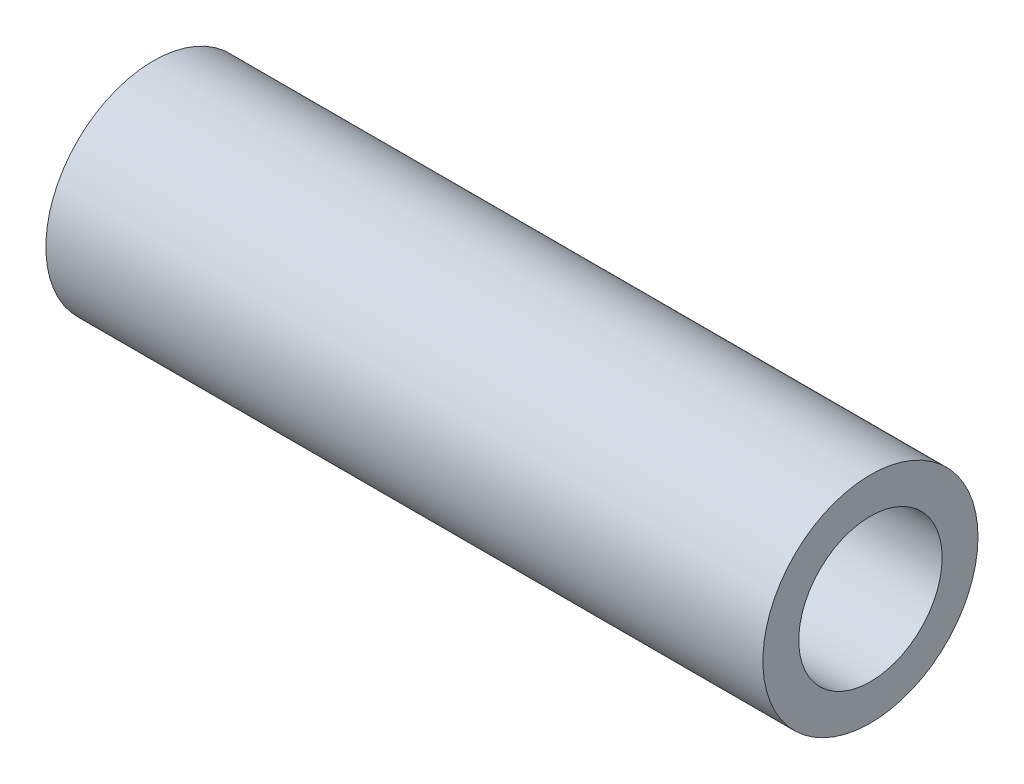
ISO-10303-21;
HEADER;
FILE_DESCRIPTION(('STEP AP214'),'2;1');
FILE_NAME('part.step','',(''),(''),'','','');
FILE_SCHEMA(('AUTOMOTIVE_DESIGN { 1 0 10303 214 1 1 1 1 }'));
ENDSEC;
DATA;
#1=APPLICATION_CONTEXT('core data for automotive mechanical design processes');
#2=APPLICATION_PROTOCOL_DEFINITION('international standard','automotive_design',2000,#1);
#3=PRODUCT_CONTEXT('',#1,'mechanical');
#4=PRODUCT('Part','Part','',(#3));
#5=PRODUCT_RELATED_PRODUCT_CATEGORY('part','',(#4));
#6=PRODUCT_DEFINITION_FORMATION('','',#4);
#7=PRODUCT_DEFINITION_CONTEXT('part definition',#1,'design');
#8=PRODUCT_DEFINITION('design','',#6,#7);
#9=PRODUCT_DEFINITION_SHAPE('','',#8);
#10=(LENGTH_UNIT() NAMED_UNIT(*) SI_UNIT(.MILLI.,.METRE.));
#11=(NAMED_UNIT(*) PLANE_ANGLE_UNIT() SI_UNIT($,.RADIAN.));
#12=(NAMED_UNIT(*) SI_UNIT($,.STERADIAN.) SOLID_ANGLE_UNIT());
#13=UNCERTAINTY_MEASURE_WITH_UNIT(LENGTH_MEASURE(1.E-05),#10,'distance_accuracy_value','');
#14=(GEOMETRIC_REPRESENTATION_CONTEXT(3) GLOBAL_UNCERTAINTY_ASSIGNED_CONTEXT((#13)) GLOBAL_UNIT_ASSIGNED_CONTEXT((#10,
#11,#12)) REPRESENTATION_CONTEXT('',''));
#15=CARTESIAN_POINT('',(0.,0.,0.));
#16=DIRECTION('',(0.,0.,1.));
#17=DIRECTION('',(1.,0.,0.));
#18=AXIS2_PLACEMENT_3D('',#15,#16,#17);
#19=CARTESIAN_POINT('',(10.,0.,0.));
#20=DIRECTION('',(1.,0.,0.));
#21=DIRECTION('',(0.,0.,-1.));
#22=AXIS2_PLACEMENT_3D('',#19,#20,#21);
#23=PLANE('',#22);
#24=CARTESIAN_POINT('',(10.,0.,0.));
#25=DIRECTION('',(1.,0.,0.));
#26=DIRECTION('',(0.,0.,-1.));
#27=AXIS2_PLACEMENT_3D('',#24,#25,#26);
#28=CIRCLE('',#27,1.5);
#29=CARTESIAN_POINT('',(10.,0.,-1.5));
#30=VERTEX_POINT('',#29);
#31=EDGE_CURVE('E10',#30,#30,#28,.T.);
#32=ORIENTED_EDGE('',*,*,#31,.T.);
#33=EDGE_LOOP('',(#32));
#34=FACE_BOUND('',#33,.T.);
#35=CARTESIAN_POINT('',(10.,0.,0.));
#36=DIRECTION('',(1.,0.,0.));
#37=DIRECTION('',(0.,0.,-1.));
#38=AXIS2_PLACEMENT_3D('',#35,#36,#37);
#39=CIRCLE('',#38,1.);
#40=CARTESIAN_POINT('',(10.,0.,-1.));
#41=VERTEX_POINT('',#40);
#42=EDGE_CURVE('E42',#41,#41,#39,.T.);
#43=ORIENTED_EDGE('',*,*,#42,.F.);
#44=EDGE_LOOP('',(#43));
#45=FACE_BOUND('',#44,.T.);
#46=ADVANCED_FACE('F31',(#34,#45),#23,.T.);
#47=CARTESIAN_POINT('',(0.,0.,0.));
#48=DIRECTION('',(1.,0.,0.));
#49=DIRECTION('',(0.,0.,-1.));
#50=AXIS2_PLACEMENT_3D('',#47,#48,#49);
#51=PLANE('',#50);
#52=CARTESIAN_POINT('',(0.,0.,0.));
#53=DIRECTION('',(1.,0.,0.));
#54=DIRECTION('',(0.,0.,-1.));
#55=AXIS2_PLACEMENT_3D('',#52,#53,#54);
#56=CIRCLE('',#55,1.5);
#57=CARTESIAN_POINT('',(0.,0.,-1.5));
#58=VERTEX_POINT('',#57);
#59=EDGE_CURVE('E35',#58,#58,#56,.T.);
#60=ORIENTED_EDGE('',*,*,#59,.F.);
#61=EDGE_LOOP('',(#60));
#62=FACE_BOUND('',#61,.T.);
#63=CARTESIAN_POINT('',(0.,0.,0.));
#64=DIRECTION('',(1.,0.,0.));
#65=DIRECTION('',(0.,0.,-1.));
#66=AXIS2_PLACEMENT_3D('',#63,#64,#65);
#67=CIRCLE('',#66,1.);
#68=CARTESIAN_POINT('',(0.,0.,-1.));
#69=VERTEX_POINT('',#68);
#70=EDGE_CURVE('E44',#69,#69,#67,.T.);
#71=ORIENTED_EDGE('',*,*,#70,.T.);
#72=EDGE_LOOP('',(#71));
#73=FACE_BOUND('',#72,.T.);
#74=ADVANCED_FACE('F54',(#62,#73),#51,.F.);
#75=CARTESIAN_POINT('',(10.,0.,0.));
#76=DIRECTION('',(-1.,0.,0.));
#77=DIRECTION('',(0.,0.,1.));
#78=AXIS2_PLACEMENT_3D('',#75,#76,#77);
#79=CYLINDRICAL_SURFACE('',#78,1.5);
#80=ORIENTED_EDGE('',*,*,#31,.F.);
#81=EDGE_LOOP('',(#80));
#82=FACE_BOUND('',#81,.T.);
#83=ORIENTED_EDGE('',*,*,#59,.T.);
#84=EDGE_LOOP('',(#83));
#85=FACE_BOUND('',#84,.T.);
#86=ADVANCED_FACE('F33',(#82,#85),#79,.T.);
#87=CARTESIAN_POINT('',(10.,0.,0.));
#88=DIRECTION('',(-1.,0.,0.));
#89=DIRECTION('',(0.,0.,1.));
#90=AXIS2_PLACEMENT_3D('',#87,#88,#89);
#91=CYLINDRICAL_SURFACE('',#90,1.);
#92=ORIENTED_EDGE('',*,*,#42,.T.);
#93=EDGE_LOOP('',(#92));
#94=FACE_BOUND('',#93,.T.);
#95=ORIENTED_EDGE('',*,*,#70,.F.);
#96=EDGE_LOOP('',(#95));
#97=FACE_BOUND('',#96,.T.);
#98=ADVANCED_FACE('F50',(#94,#97),#91,.F.);
#99=CLOSED_SHELL('',(#46,#74,#86,#98));
#100=MANIFOLD_SOLID_BREP('B2',#99);
#101=ADVANCED_BREP_SHAPE_REPRESENTATION('',(#18,#100),#14);
#102=SHAPE_DEFINITION_REPRESENTATION(#9,#101);
ENDSEC;
END-ISO-10303-21;
